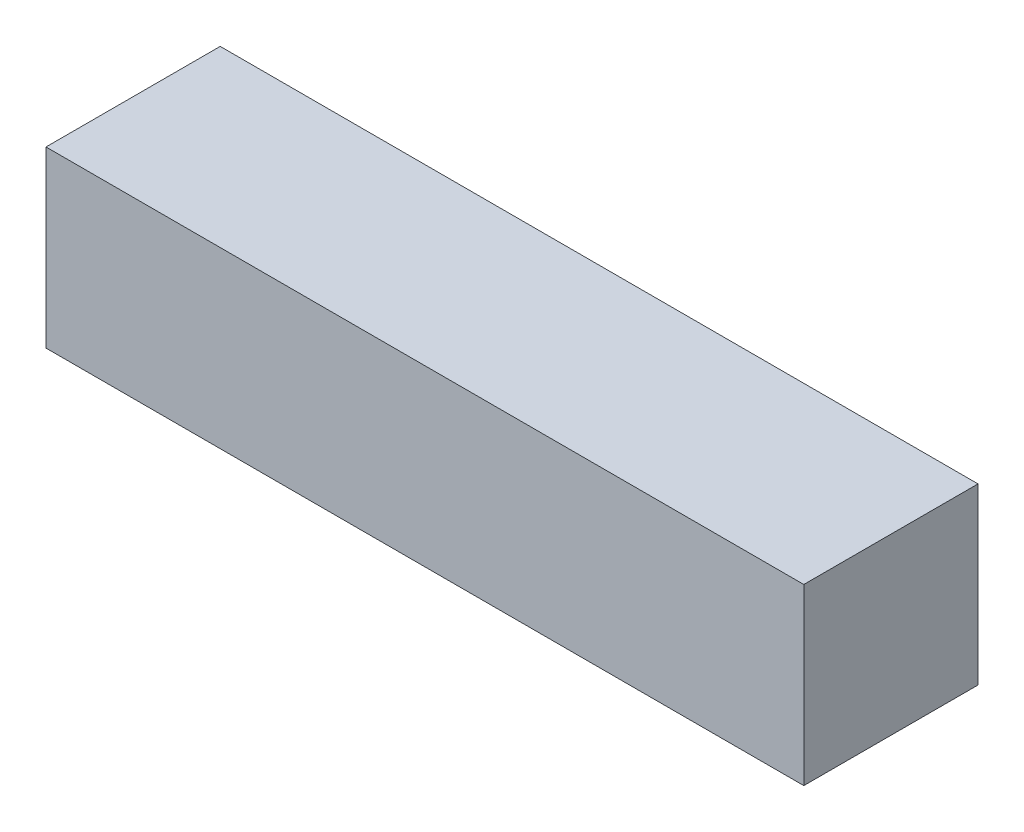
ISO-10303-21;
HEADER;
FILE_DESCRIPTION(('STEP AP214'),'2;1');
FILE_NAME('part.step','',(''),(''),'','','');
FILE_SCHEMA(('AUTOMOTIVE_DESIGN { 1 0 10303 214 1 1 1 1 }'));
ENDSEC;
DATA;
#1=APPLICATION_CONTEXT('core data for automotive mechanical design processes');
#2=APPLICATION_PROTOCOL_DEFINITION('international standard','automotive_design',2000,#1);
#3=PRODUCT_CONTEXT('',#1,'mechanical');
#4=PRODUCT('Part','Part','',(#3));
#5=PRODUCT_RELATED_PRODUCT_CATEGORY('part','',(#4));
#6=PRODUCT_DEFINITION_FORMATION('','',#4);
#7=PRODUCT_DEFINITION_CONTEXT('part definition',#1,'design');
#8=PRODUCT_DEFINITION('design','',#6,#7);
#9=PRODUCT_DEFINITION_SHAPE('','',#8);
#10=(LENGTH_UNIT() NAMED_UNIT(*) SI_UNIT(.MILLI.,.METRE.));
#11=(NAMED_UNIT(*) PLANE_ANGLE_UNIT() SI_UNIT($,.RADIAN.));
#12=(NAMED_UNIT(*) SI_UNIT($,.STERADIAN.) SOLID_ANGLE_UNIT());
#13=UNCERTAINTY_MEASURE_WITH_UNIT(LENGTH_MEASURE(1.E-05),#10,'distance_accuracy_value','');
#14=(GEOMETRIC_REPRESENTATION_CONTEXT(3) GLOBAL_UNCERTAINTY_ASSIGNED_CONTEXT((#13)) GLOBAL_UNIT_ASSIGNED_CONTEXT((#10,
#11,#12)) REPRESENTATION_CONTEXT('',''));
#15=CARTESIAN_POINT('',(0.,0.,0.));
#16=DIRECTION('',(0.,0.,1.));
#17=DIRECTION('',(1.,0.,0.));
#18=AXIS2_PLACEMENT_3D('',#15,#16,#17);
#19=CARTESIAN_POINT('',(43.5,10.,20.));
#20=DIRECTION('',(-1.,0.,0.));
#21=DIRECTION('',(0.,-1.,0.));
#22=AXIS2_PLACEMENT_3D('',#19,#20,#21);
#23=PLANE('',#22);
#24=DIRECTION('',(0.,1.,0.));
#25=VECTOR('',#24,1.);
#26=CARTESIAN_POINT('',(43.5,10.,0.));
#27=LINE('',#26,#25);
#28=CARTESIAN_POINT('',(43.5,-10.,0.));
#29=VERTEX_POINT('',#28);
#30=CARTESIAN_POINT('',(43.5,10.,0.));
#31=VERTEX_POINT('',#30);
#32=EDGE_CURVE('E107',#29,#31,#27,.T.);
#33=ORIENTED_EDGE('',*,*,#32,.T.);
#34=DIRECTION('',(0.,0.,-1.));
#35=VECTOR('',#34,1.);
#36=CARTESIAN_POINT('',(43.5,10.,20.));
#37=LINE('',#36,#35);
#38=CARTESIAN_POINT('',(43.5,10.,20.));
#39=VERTEX_POINT('',#38);
#40=EDGE_CURVE('E11',#39,#31,#37,.T.);
#41=ORIENTED_EDGE('',*,*,#40,.F.);
#42=DIRECTION('',(0.,1.,0.));
#43=VECTOR('',#42,1.);
#44=CARTESIAN_POINT('',(43.5,10.,20.));
#45=LINE('',#44,#43);
#46=CARTESIAN_POINT('',(43.5,-10.,20.));
#47=VERTEX_POINT('',#46);
#48=EDGE_CURVE('E91',#47,#39,#45,.T.);
#49=ORIENTED_EDGE('',*,*,#48,.F.);
#50=DIRECTION('',(0.,0.,-1.));
#51=VECTOR('',#50,1.);
#52=CARTESIAN_POINT('',(43.5,-10.,20.));
#53=LINE('',#52,#51);
#54=EDGE_CURVE('E103',#47,#29,#53,.T.);
#55=ORIENTED_EDGE('',*,*,#54,.T.);
#56=EDGE_LOOP('',(#33,#41,#49,#55));
#57=FACE_BOUND('',#56,.T.);
#58=ADVANCED_FACE('F39',(#57),#23,.F.);
#59=CARTESIAN_POINT('',(-43.5,10.,20.));
#60=DIRECTION('',(0.,-1.,0.));
#61=DIRECTION('',(0.,0.,-1.));
#62=AXIS2_PLACEMENT_3D('',#59,#60,#61);
#63=PLANE('',#62);
#64=DIRECTION('',(-1.,0.,0.));
#65=VECTOR('',#64,1.);
#66=CARTESIAN_POINT('',(-43.5,10.,0.));
#67=LINE('',#66,#65);
#68=CARTESIAN_POINT('',(-43.5,10.,0.));
#69=VERTEX_POINT('',#68);
#70=EDGE_CURVE('E96',#31,#69,#67,.T.);
#71=ORIENTED_EDGE('',*,*,#70,.T.);
#72=DIRECTION('',(0.,0.,-1.));
#73=VECTOR('',#72,1.);
#74=CARTESIAN_POINT('',(-43.5,10.,20.));
#75=LINE('',#74,#73);
#76=CARTESIAN_POINT('',(-43.5,10.,20.));
#77=VERTEX_POINT('',#76);
#78=EDGE_CURVE('E48',#77,#69,#75,.T.);
#79=ORIENTED_EDGE('',*,*,#78,.F.);
#80=DIRECTION('',(-1.,0.,0.));
#81=VECTOR('',#80,1.);
#82=CARTESIAN_POINT('',(-43.5,10.,20.));
#83=LINE('',#82,#81);
#84=EDGE_CURVE('E86',#39,#77,#83,.T.);
#85=ORIENTED_EDGE('',*,*,#84,.F.);
#86=ORIENTED_EDGE('',*,*,#40,.T.);
#87=EDGE_LOOP('',(#71,#79,#85,#86));
#88=FACE_BOUND('',#87,.T.);
#89=ADVANCED_FACE('F95',(#88),#63,.F.);
#90=CARTESIAN_POINT('',(-43.5,10.,20.));
#91=DIRECTION('',(1.,0.,0.));
#92=DIRECTION('',(0.,1.,0.));
#93=AXIS2_PLACEMENT_3D('',#90,#91,#92);
#94=PLANE('',#93);
#95=DIRECTION('',(0.,-1.,0.));
#96=VECTOR('',#95,1.);
#97=CARTESIAN_POINT('',(-43.5,10.,0.));
#98=LINE('',#97,#96);
#99=CARTESIAN_POINT('',(-43.5,-10.,0.));
#100=VERTEX_POINT('',#99);
#101=EDGE_CURVE('E73',#69,#100,#98,.T.);
#102=ORIENTED_EDGE('',*,*,#101,.T.);
#103=DIRECTION('',(0.,0.,-1.));
#104=VECTOR('',#103,1.);
#105=CARTESIAN_POINT('',(-43.5,-10.,20.));
#106=LINE('',#105,#104);
#107=CARTESIAN_POINT('',(-43.5,-10.,20.));
#108=VERTEX_POINT('',#107);
#109=EDGE_CURVE('E98',#108,#100,#106,.T.);
#110=ORIENTED_EDGE('',*,*,#109,.F.);
#111=DIRECTION('',(0.,-1.,0.));
#112=VECTOR('',#111,1.);
#113=CARTESIAN_POINT('',(-43.5,10.,20.));
#114=LINE('',#113,#112);
#115=EDGE_CURVE('E89',#77,#108,#114,.T.);
#116=ORIENTED_EDGE('',*,*,#115,.F.);
#117=ORIENTED_EDGE('',*,*,#78,.T.);
#118=EDGE_LOOP('',(#102,#110,#116,#117));
#119=FACE_BOUND('',#118,.T.);
#120=ADVANCED_FACE('F99',(#119),#94,.F.);
#121=CARTESIAN_POINT('',(-43.5,-10.,20.));
#122=DIRECTION('',(0.,1.,0.));
#123=DIRECTION('',(0.,0.,1.));
#124=AXIS2_PLACEMENT_3D('',#121,#122,#123);
#125=PLANE('',#124);
#126=DIRECTION('',(1.,0.,0.));
#127=VECTOR('',#126,1.);
#128=CARTESIAN_POINT('',(-43.5,-10.,0.));
#129=LINE('',#128,#127);
#130=EDGE_CURVE('E79',#100,#29,#129,.T.);
#131=ORIENTED_EDGE('',*,*,#130,.T.);
#132=ORIENTED_EDGE('',*,*,#54,.F.);
#133=DIRECTION('',(1.,0.,0.));
#134=VECTOR('',#133,1.);
#135=CARTESIAN_POINT('',(-43.5,-10.,20.));
#136=LINE('',#135,#134);
#137=EDGE_CURVE('E56',#108,#47,#136,.T.);
#138=ORIENTED_EDGE('',*,*,#137,.F.);
#139=ORIENTED_EDGE('',*,*,#109,.T.);
#140=EDGE_LOOP('',(#131,#132,#138,#139));
#141=FACE_BOUND('',#140,.T.);
#142=ADVANCED_FACE('F120',(#141),#125,.F.);
#143=CARTESIAN_POINT('',(0.,0.,20.));
#144=DIRECTION('',(0.,0.,1.));
#145=DIRECTION('',(1.,0.,0.));
#146=AXIS2_PLACEMENT_3D('',#143,#144,#145);
#147=PLANE('',#146);
#148=ORIENTED_EDGE('',*,*,#48,.T.);
#149=ORIENTED_EDGE('',*,*,#84,.T.);
#150=ORIENTED_EDGE('',*,*,#115,.T.);
#151=ORIENTED_EDGE('',*,*,#137,.T.);
#152=EDGE_LOOP('',(#148,#149,#150,#151));
#153=FACE_BOUND('',#152,.T.);
#154=ADVANCED_FACE('F87',(#153),#147,.T.);
#155=CARTESIAN_POINT('',(0.,0.,0.));
#156=DIRECTION('',(0.,0.,1.));
#157=DIRECTION('',(1.,0.,0.));
#158=AXIS2_PLACEMENT_3D('',#155,#156,#157);
#159=PLANE('',#158);
#160=ORIENTED_EDGE('',*,*,#32,.F.);
#161=ORIENTED_EDGE('',*,*,#130,.F.);
#162=ORIENTED_EDGE('',*,*,#101,.F.);
#163=ORIENTED_EDGE('',*,*,#70,.F.);
#164=EDGE_LOOP('',(#160,#161,#162,#163));
#165=FACE_BOUND('',#164,.T.);
#166=ADVANCED_FACE('F123',(#165),#159,.F.);
#167=CLOSED_SHELL('',(#58,#89,#120,#142,#154,#166));
#168=MANIFOLD_SOLID_BREP('B2',#167);
#169=ADVANCED_BREP_SHAPE_REPRESENTATION('',(#18,#168),#14);
#170=SHAPE_DEFINITION_REPRESENTATION(#9,#169);
ENDSEC;
END-ISO-10303-21;
